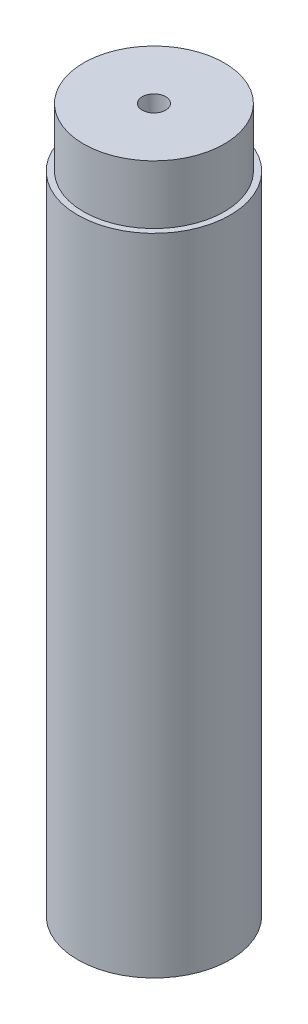
ISO-10303-21;
HEADER;
FILE_DESCRIPTION(('STEP AP214'),'2;1');
FILE_NAME('part.step','',(''),(''),'','','');
FILE_SCHEMA(('AUTOMOTIVE_DESIGN { 1 0 10303 214 1 1 1 1 }'));
ENDSEC;
DATA;
#1=APPLICATION_CONTEXT('core data for automotive mechanical design processes');
#2=APPLICATION_PROTOCOL_DEFINITION('international standard','automotive_design',2000,#1);
#3=PRODUCT_CONTEXT('',#1,'mechanical');
#4=PRODUCT('Part','Part','',(#3));
#5=PRODUCT_RELATED_PRODUCT_CATEGORY('part','',(#4));
#6=PRODUCT_DEFINITION_FORMATION('','',#4);
#7=PRODUCT_DEFINITION_CONTEXT('part definition',#1,'design');
#8=PRODUCT_DEFINITION('design','',#6,#7);
#9=PRODUCT_DEFINITION_SHAPE('','',#8);
#10=(LENGTH_UNIT() NAMED_UNIT(*) SI_UNIT(.MILLI.,.METRE.));
#11=(NAMED_UNIT(*) PLANE_ANGLE_UNIT() SI_UNIT($,.RADIAN.));
#12=(NAMED_UNIT(*) SI_UNIT($,.STERADIAN.) SOLID_ANGLE_UNIT());
#13=UNCERTAINTY_MEASURE_WITH_UNIT(LENGTH_MEASURE(1.E-05),#10,'distance_accuracy_value','');
#14=(GEOMETRIC_REPRESENTATION_CONTEXT(3) GLOBAL_UNCERTAINTY_ASSIGNED_CONTEXT((#13)) GLOBAL_UNIT_ASSIGNED_CONTEXT((#10,
#11,#12)) REPRESENTATION_CONTEXT('',''));
#15=CARTESIAN_POINT('',(0.,0.,0.));
#16=DIRECTION('',(0.,0.,1.));
#17=DIRECTION('',(1.,0.,0.));
#18=AXIS2_PLACEMENT_3D('',#15,#16,#17);
#19=CARTESIAN_POINT('',(0.,300.,0.));
#20=DIRECTION('',(0.,1.,0.));
#21=DIRECTION('',(0.,0.,1.));
#22=AXIS2_PLACEMENT_3D('',#19,#20,#21);
#23=PLANE('',#22);
#24=CARTESIAN_POINT('',(0.,300.,0.));
#25=DIRECTION('',(0.,1.,0.));
#26=DIRECTION('',(0.,0.,1.));
#27=AXIS2_PLACEMENT_3D('',#24,#25,#26);
#28=CIRCLE('',#27,5.);
#29=CARTESIAN_POINT('',(0.,300.,5.));
#30=VERTEX_POINT('',#29);
#31=EDGE_CURVE('E38',#30,#30,#28,.T.);
#32=ORIENTED_EDGE('',*,*,#31,.F.);
#33=EDGE_LOOP('',(#32));
#34=FACE_BOUND('',#33,.T.);
#35=CARTESIAN_POINT('',(0.,300.,0.));
#36=DIRECTION('',(0.,1.,0.));
#37=DIRECTION('',(0.,0.,1.));
#38=AXIS2_PLACEMENT_3D('',#35,#36,#37);
#39=CIRCLE('',#38,30.);
#40=CARTESIAN_POINT('',(0.,300.,30.));
#41=VERTEX_POINT('',#40);
#42=EDGE_CURVE('E52',#41,#41,#39,.T.);
#43=ORIENTED_EDGE('',*,*,#42,.T.);
#44=EDGE_LOOP('',(#43));
#45=FACE_BOUND('',#44,.T.);
#46=ADVANCED_FACE('F31',(#34,#45),#23,.T.);
#47=CARTESIAN_POINT('',(0.,300.,0.));
#48=DIRECTION('',(0.,-1.,0.));
#49=DIRECTION('',(0.,0.,-1.));
#50=AXIS2_PLACEMENT_3D('',#47,#48,#49);
#51=CYLINDRICAL_SURFACE('',#50,32.5);
#52=CARTESIAN_POINT('',(0.,0.,0.));
#53=DIRECTION('',(0.,1.,0.));
#54=DIRECTION('',(0.,0.,1.));
#55=AXIS2_PLACEMENT_3D('',#52,#53,#54);
#56=CIRCLE('',#55,32.5);
#57=CARTESIAN_POINT('',(0.,0.,32.5));
#58=VERTEX_POINT('',#57);
#59=EDGE_CURVE('E10',#58,#58,#56,.T.);
#60=ORIENTED_EDGE('',*,*,#59,.T.);
#61=EDGE_LOOP('',(#60));
#62=FACE_BOUND('',#61,.T.);
#63=CARTESIAN_POINT('',(0.,275.,0.));
#64=DIRECTION('',(0.,1.,0.));
#65=DIRECTION('',(0.,0.,1.));
#66=AXIS2_PLACEMENT_3D('',#63,#64,#65);
#67=CIRCLE('',#66,32.5);
#68=CARTESIAN_POINT('',(0.,275.,32.5));
#69=VERTEX_POINT('',#68);
#70=EDGE_CURVE('E47',#69,#69,#67,.T.);
#71=ORIENTED_EDGE('',*,*,#70,.F.);
#72=EDGE_LOOP('',(#71));
#73=FACE_BOUND('',#72,.T.);
#74=ADVANCED_FACE('F33',(#62,#73),#51,.T.);
#75=CARTESIAN_POINT('',(0.,0.,0.));
#76=DIRECTION('',(0.,1.,0.));
#77=DIRECTION('',(0.,0.,1.));
#78=AXIS2_PLACEMENT_3D('',#75,#76,#77);
#79=PLANE('',#78);
#80=ORIENTED_EDGE('',*,*,#59,.F.);
#81=EDGE_LOOP('',(#80));
#82=FACE_BOUND('',#81,.T.);
#83=CARTESIAN_POINT('',(0.,0.,0.));
#84=DIRECTION('',(0.,1.,0.));
#85=DIRECTION('',(0.,0.,1.));
#86=AXIS2_PLACEMENT_3D('',#83,#84,#85);
#87=CIRCLE('',#86,5.);
#88=CARTESIAN_POINT('',(0.,0.,5.));
#89=VERTEX_POINT('',#88);
#90=EDGE_CURVE('E42',#89,#89,#87,.T.);
#91=ORIENTED_EDGE('',*,*,#90,.T.);
#92=EDGE_LOOP('',(#91));
#93=FACE_BOUND('',#92,.T.);
#94=ADVANCED_FACE('F69',(#82,#93),#79,.F.);
#95=CARTESIAN_POINT('',(0.,300.,0.));
#96=DIRECTION('',(0.,-1.,0.));
#97=DIRECTION('',(0.,0.,-1.));
#98=AXIS2_PLACEMENT_3D('',#95,#96,#97);
#99=CYLINDRICAL_SURFACE('',#98,5.);
#100=ORIENTED_EDGE('',*,*,#31,.T.);
#101=EDGE_LOOP('',(#100));
#102=FACE_BOUND('',#101,.T.);
#103=ORIENTED_EDGE('',*,*,#90,.F.);
#104=EDGE_LOOP('',(#103));
#105=FACE_BOUND('',#104,.T.);
#106=ADVANCED_FACE('F64',(#102,#105),#99,.F.);
#107=CARTESIAN_POINT('',(0.,275.,0.));
#108=DIRECTION('',(0.,1.,0.));
#109=DIRECTION('',(0.,0.,1.));
#110=AXIS2_PLACEMENT_3D('',#107,#108,#109);
#111=PLANE('',#110);
#112=CARTESIAN_POINT('',(0.,275.,0.));
#113=DIRECTION('',(0.,1.,0.));
#114=DIRECTION('',(0.,0.,1.));
#115=AXIS2_PLACEMENT_3D('',#112,#113,#114);
#116=CIRCLE('',#115,30.);
#117=CARTESIAN_POINT('',(0.,275.,30.));
#118=VERTEX_POINT('',#117);
#119=EDGE_CURVE('E51',#118,#118,#116,.T.);
#120=ORIENTED_EDGE('',*,*,#119,.F.);
#121=EDGE_LOOP('',(#120));
#122=FACE_BOUND('',#121,.T.);
#123=ORIENTED_EDGE('',*,*,#70,.T.);
#124=EDGE_LOOP('',(#123));
#125=FACE_BOUND('',#124,.T.);
#126=ADVANCED_FACE('F61',(#122,#125),#111,.T.);
#127=CARTESIAN_POINT('',(0.,275.,0.));
#128=DIRECTION('',(0.,1.,0.));
#129=DIRECTION('',(0.,0.,1.));
#130=AXIS2_PLACEMENT_3D('',#127,#128,#129);
#131=CYLINDRICAL_SURFACE('',#130,30.);
#132=ORIENTED_EDGE('',*,*,#119,.T.);
#133=EDGE_LOOP('',(#132));
#134=FACE_BOUND('',#133,.T.);
#135=ORIENTED_EDGE('',*,*,#42,.F.);
#136=EDGE_LOOP('',(#135));
#137=FACE_BOUND('',#136,.T.);
#138=ADVANCED_FACE('F58',(#134,#137),#131,.T.);
#139=CLOSED_SHELL('',(#46,#74,#94,#106,#126,#138));
#140=MANIFOLD_SOLID_BREP('B2',#139);
#141=ADVANCED_BREP_SHAPE_REPRESENTATION('',(#18,#140),#14);
#142=SHAPE_DEFINITION_REPRESENTATION(#9,#141);
ENDSEC;
END-ISO-10303-21;
